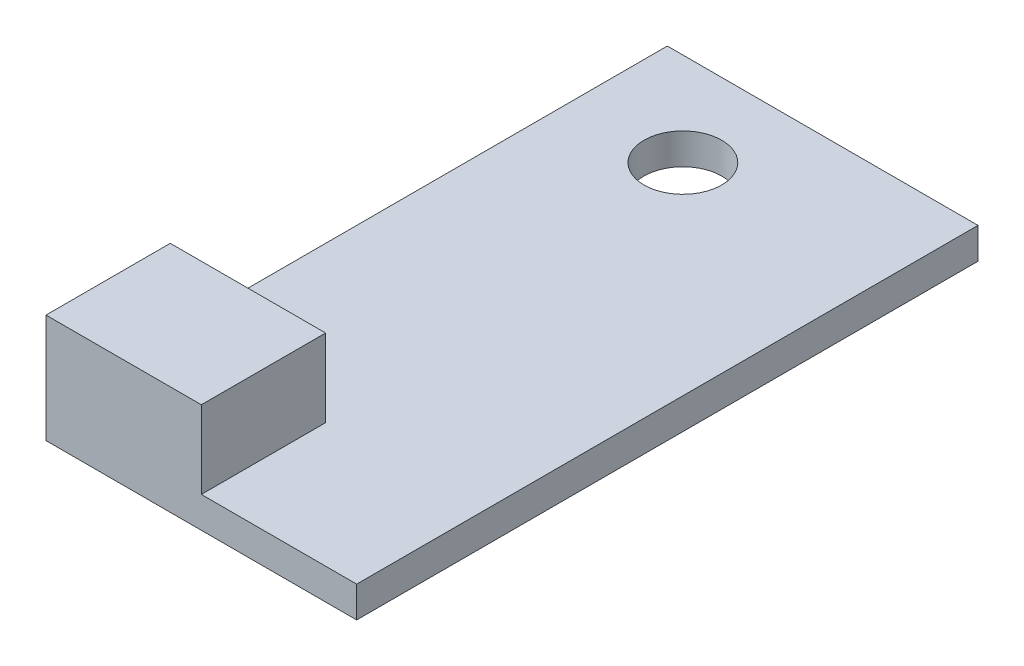
ISO-10303-21;
HEADER;
FILE_DESCRIPTION(('STEP AP214'),'2;1');
FILE_NAME('part.step','',(''),(''),'','','');
FILE_SCHEMA(('AUTOMOTIVE_DESIGN { 1 0 10303 214 1 1 1 1 }'));
ENDSEC;
DATA;
#1=APPLICATION_CONTEXT('core data for automotive mechanical design processes');
#2=APPLICATION_PROTOCOL_DEFINITION('international standard','automotive_design',2000,#1);
#3=PRODUCT_CONTEXT('',#1,'mechanical');
#4=PRODUCT('Part','Part','',(#3));
#5=PRODUCT_RELATED_PRODUCT_CATEGORY('part','',(#4));
#6=PRODUCT_DEFINITION_FORMATION('','',#4);
#7=PRODUCT_DEFINITION_CONTEXT('part definition',#1,'design');
#8=PRODUCT_DEFINITION('design','',#6,#7);
#9=PRODUCT_DEFINITION_SHAPE('','',#8);
#10=(LENGTH_UNIT() NAMED_UNIT(*) SI_UNIT(.MILLI.,.METRE.));
#11=(NAMED_UNIT(*) PLANE_ANGLE_UNIT() SI_UNIT($,.RADIAN.));
#12=(NAMED_UNIT(*) SI_UNIT($,.STERADIAN.) SOLID_ANGLE_UNIT());
#13=UNCERTAINTY_MEASURE_WITH_UNIT(LENGTH_MEASURE(1.E-05),#10,'distance_accuracy_value','');
#14=(GEOMETRIC_REPRESENTATION_CONTEXT(3) GLOBAL_UNCERTAINTY_ASSIGNED_CONTEXT((#13)) GLOBAL_UNIT_ASSIGNED_CONTEXT((#10,
#11,#12)) REPRESENTATION_CONTEXT('',''));
#15=CARTESIAN_POINT('',(0.,0.,0.));
#16=DIRECTION('',(0.,0.,1.));
#17=DIRECTION('',(1.,0.,0.));
#18=AXIS2_PLACEMENT_3D('',#15,#16,#17);
#19=CARTESIAN_POINT('',(0.,10.,0.));
#20=DIRECTION('',(0.,-1.,0.));
#21=DIRECTION('',(0.,0.,-1.));
#22=AXIS2_PLACEMENT_3D('',#19,#20,#21);
#23=PLANE('',#22);
#24=CARTESIAN_POINT('',(35.,10.,-170.));
#25=DIRECTION('',(0.,1.,0.));
#26=DIRECTION('',(0.,0.,1.));
#27=AXIS2_PLACEMENT_3D('',#24,#25,#26);
#28=CIRCLE('',#27,12.5);
#29=CARTESIAN_POINT('',(35.,10.,-157.5));
#30=VERTEX_POINT('',#29);
#31=EDGE_CURVE('E117',#30,#30,#28,.T.);
#32=ORIENTED_EDGE('',*,*,#31,.F.);
#33=EDGE_LOOP('',(#32));
#34=FACE_BOUND('',#33,.T.);
#35=DIRECTION('',(-1.,0.,0.));
#36=VECTOR('',#35,1.);
#37=CARTESIAN_POINT('',(0.,10.,-40.));
#38=LINE('',#37,#36);
#39=CARTESIAN_POINT('',(50.,10.,-40.));
#40=VERTEX_POINT('',#39);
#41=CARTESIAN_POINT('',(0.,10.,-40.));
#42=VERTEX_POINT('',#41);
#43=EDGE_CURVE('E113',#40,#42,#38,.T.);
#44=ORIENTED_EDGE('',*,*,#43,.F.);
#45=DIRECTION('',(0.,0.,-1.));
#46=VECTOR('',#45,1.);
#47=CARTESIAN_POINT('',(50.,10.,0.));
#48=LINE('',#47,#46);
#49=CARTESIAN_POINT('',(50.,10.,0.));
#50=VERTEX_POINT('',#49);
#51=EDGE_CURVE('E49',#50,#40,#48,.T.);
#52=ORIENTED_EDGE('',*,*,#51,.F.);
#53=DIRECTION('',(1.,0.,0.));
#54=VECTOR('',#53,1.);
#55=CARTESIAN_POINT('',(0.,10.,0.));
#56=LINE('',#55,#54);
#57=CARTESIAN_POINT('',(100.,10.,0.));
#58=VERTEX_POINT('',#57);
#59=EDGE_CURVE('E129',#50,#58,#56,.T.);
#60=ORIENTED_EDGE('',*,*,#59,.T.);
#61=DIRECTION('',(0.,0.,-1.));
#62=VECTOR('',#61,1.);
#63=CARTESIAN_POINT('',(100.,10.,0.));
#64=LINE('',#63,#62);
#65=CARTESIAN_POINT('',(100.,10.,-200.));
#66=VERTEX_POINT('',#65);
#67=EDGE_CURVE('E132',#58,#66,#64,.T.);
#68=ORIENTED_EDGE('',*,*,#67,.T.);
#69=DIRECTION('',(-1.,0.,0.));
#70=VECTOR('',#69,1.);
#71=CARTESIAN_POINT('',(0.,10.,-200.));
#72=LINE('',#71,#70);
#73=CARTESIAN_POINT('',(0.,10.,-200.));
#74=VERTEX_POINT('',#73);
#75=EDGE_CURVE('E134',#66,#74,#72,.T.);
#76=ORIENTED_EDGE('',*,*,#75,.T.);
#77=DIRECTION('',(0.,0.,1.));
#78=VECTOR('',#77,1.);
#79=CARTESIAN_POINT('',(0.,10.,0.));
#80=LINE('',#79,#78);
#81=EDGE_CURVE('E55',#74,#42,#80,.T.);
#82=ORIENTED_EDGE('',*,*,#81,.T.);
#83=EDGE_LOOP('',(#44,#52,#60,#68,#76,#82));
#84=FACE_BOUND('',#83,.T.);
#85=ADVANCED_FACE('F33',(#34,#84),#23,.F.);
#86=CARTESIAN_POINT('',(0.,10.,0.));
#87=DIRECTION('',(1.,0.,0.));
#88=DIRECTION('',(0.,0.,-1.));
#89=AXIS2_PLACEMENT_3D('',#86,#87,#88);
#90=PLANE('',#89);
#91=DIRECTION('',(0.,0.,1.));
#92=VECTOR('',#91,1.);
#93=CARTESIAN_POINT('',(0.,0.,0.));
#94=LINE('',#93,#92);
#95=CARTESIAN_POINT('',(0.,0.,-200.));
#96=VERTEX_POINT('',#95);
#97=CARTESIAN_POINT('',(0.,0.,0.));
#98=VERTEX_POINT('',#97);
#99=EDGE_CURVE('E98',#96,#98,#94,.T.);
#100=ORIENTED_EDGE('',*,*,#99,.T.);
#101=DIRECTION('',(0.,-1.,0.));
#102=VECTOR('',#101,1.);
#103=CARTESIAN_POINT('',(0.,10.,0.));
#104=LINE('',#103,#102);
#105=CARTESIAN_POINT('',(0.,35.,0.));
#106=VERTEX_POINT('',#105);
#107=EDGE_CURVE('E11',#106,#98,#104,.T.);
#108=ORIENTED_EDGE('',*,*,#107,.F.);
#109=DIRECTION('',(0.,0.,1.));
#110=VECTOR('',#109,1.);
#111=CARTESIAN_POINT('',(0.,35.,0.));
#112=LINE('',#111,#110);
#113=CARTESIAN_POINT('',(0.,35.,-40.));
#114=VERTEX_POINT('',#113);
#115=EDGE_CURVE('E95',#114,#106,#112,.T.);
#116=ORIENTED_EDGE('',*,*,#115,.F.);
#117=DIRECTION('',(0.,-1.,0.));
#118=VECTOR('',#117,1.);
#119=CARTESIAN_POINT('',(0.,35.,-40.));
#120=LINE('',#119,#118);
#121=EDGE_CURVE('E121',#114,#42,#120,.T.);
#122=ORIENTED_EDGE('',*,*,#121,.T.);
#123=ORIENTED_EDGE('',*,*,#81,.F.);
#124=DIRECTION('',(0.,-1.,0.));
#125=VECTOR('',#124,1.);
#126=CARTESIAN_POINT('',(0.,10.,-200.));
#127=LINE('',#126,#125);
#128=EDGE_CURVE('E136',#74,#96,#127,.T.);
#129=ORIENTED_EDGE('',*,*,#128,.T.);
#130=EDGE_LOOP('',(#100,#108,#116,#122,#123,#129));
#131=FACE_BOUND('',#130,.T.);
#132=ADVANCED_FACE('F35',(#131),#90,.F.);
#133=CARTESIAN_POINT('',(0.,10.,0.));
#134=DIRECTION('',(0.,0.,-1.));
#135=DIRECTION('',(-1.,0.,0.));
#136=AXIS2_PLACEMENT_3D('',#133,#134,#135);
#137=PLANE('',#136);
#138=DIRECTION('',(1.,0.,0.));
#139=VECTOR('',#138,1.);
#140=CARTESIAN_POINT('',(0.,0.,0.));
#141=LINE('',#140,#139);
#142=CARTESIAN_POINT('',(100.,0.,0.));
#143=VERTEX_POINT('',#142);
#144=EDGE_CURVE('E138',#98,#143,#141,.T.);
#145=ORIENTED_EDGE('',*,*,#144,.T.);
#146=DIRECTION('',(0.,-1.,0.));
#147=VECTOR('',#146,1.);
#148=CARTESIAN_POINT('',(100.,10.,0.));
#149=LINE('',#148,#147);
#150=EDGE_CURVE('E42',#58,#143,#149,.T.);
#151=ORIENTED_EDGE('',*,*,#150,.F.);
#152=ORIENTED_EDGE('',*,*,#59,.F.);
#153=DIRECTION('',(0.,-1.,0.));
#154=VECTOR('',#153,1.);
#155=CARTESIAN_POINT('',(50.,35.,0.));
#156=LINE('',#155,#154);
#157=CARTESIAN_POINT('',(50.,35.,0.));
#158=VERTEX_POINT('',#157);
#159=EDGE_CURVE('E104',#158,#50,#156,.T.);
#160=ORIENTED_EDGE('',*,*,#159,.F.);
#161=DIRECTION('',(1.,0.,0.));
#162=VECTOR('',#161,1.);
#163=CARTESIAN_POINT('',(0.,35.,0.));
#164=LINE('',#163,#162);
#165=EDGE_CURVE('E101',#106,#158,#164,.T.);
#166=ORIENTED_EDGE('',*,*,#165,.F.);
#167=ORIENTED_EDGE('',*,*,#107,.T.);
#168=EDGE_LOOP('',(#145,#151,#152,#160,#166,#167));
#169=FACE_BOUND('',#168,.T.);
#170=ADVANCED_FACE('F102',(#169),#137,.F.);
#171=CARTESIAN_POINT('',(100.,10.,0.));
#172=DIRECTION('',(-1.,0.,0.));
#173=DIRECTION('',(0.,0.,1.));
#174=AXIS2_PLACEMENT_3D('',#171,#172,#173);
#175=PLANE('',#174);
#176=DIRECTION('',(0.,0.,-1.));
#177=VECTOR('',#176,1.);
#178=CARTESIAN_POINT('',(100.,0.,0.));
#179=LINE('',#178,#177);
#180=CARTESIAN_POINT('',(100.,0.,-200.));
#181=VERTEX_POINT('',#180);
#182=EDGE_CURVE('E140',#143,#181,#179,.T.);
#183=ORIENTED_EDGE('',*,*,#182,.T.);
#184=DIRECTION('',(0.,-1.,0.));
#185=VECTOR('',#184,1.);
#186=CARTESIAN_POINT('',(100.,10.,-200.));
#187=LINE('',#186,#185);
#188=EDGE_CURVE('E144',#66,#181,#187,.T.);
#189=ORIENTED_EDGE('',*,*,#188,.F.);
#190=ORIENTED_EDGE('',*,*,#67,.F.);
#191=ORIENTED_EDGE('',*,*,#150,.T.);
#192=EDGE_LOOP('',(#183,#189,#190,#191));
#193=FACE_BOUND('',#192,.T.);
#194=ADVANCED_FACE('F152',(#193),#175,.F.);
#195=CARTESIAN_POINT('',(0.,10.,-200.));
#196=DIRECTION('',(0.,0.,1.));
#197=DIRECTION('',(1.,0.,0.));
#198=AXIS2_PLACEMENT_3D('',#195,#196,#197);
#199=PLANE('',#198);
#200=DIRECTION('',(-1.,0.,0.));
#201=VECTOR('',#200,1.);
#202=CARTESIAN_POINT('',(0.,0.,-200.));
#203=LINE('',#202,#201);
#204=EDGE_CURVE('E130',#181,#96,#203,.T.);
#205=ORIENTED_EDGE('',*,*,#204,.T.);
#206=ORIENTED_EDGE('',*,*,#128,.F.);
#207=ORIENTED_EDGE('',*,*,#75,.F.);
#208=ORIENTED_EDGE('',*,*,#188,.T.);
#209=EDGE_LOOP('',(#205,#206,#207,#208));
#210=FACE_BOUND('',#209,.T.);
#211=ADVANCED_FACE('F159',(#210),#199,.F.);
#212=CARTESIAN_POINT('',(0.,0.,0.));
#213=DIRECTION('',(0.,-1.,0.));
#214=DIRECTION('',(0.,0.,-1.));
#215=AXIS2_PLACEMENT_3D('',#212,#213,#214);
#216=PLANE('',#215);
#217=CARTESIAN_POINT('',(35.,0.,-170.));
#218=DIRECTION('',(0.,-1.,0.));
#219=DIRECTION('',(0.,0.,-1.));
#220=AXIS2_PLACEMENT_3D('',#217,#218,#219);
#221=CIRCLE('',#220,12.5);
#222=CARTESIAN_POINT('',(35.,0.,-182.5));
#223=VERTEX_POINT('',#222);
#224=EDGE_CURVE('E37',#223,#223,#221,.T.);
#225=ORIENTED_EDGE('',*,*,#224,.F.);
#226=EDGE_LOOP('',(#225));
#227=FACE_BOUND('',#226,.T.);
#228=ORIENTED_EDGE('',*,*,#99,.F.);
#229=ORIENTED_EDGE('',*,*,#204,.F.);
#230=ORIENTED_EDGE('',*,*,#182,.F.);
#231=ORIENTED_EDGE('',*,*,#144,.F.);
#232=EDGE_LOOP('',(#228,#229,#230,#231));
#233=FACE_BOUND('',#232,.T.);
#234=ADVANCED_FACE('F156',(#227,#233),#216,.T.);
#235=CARTESIAN_POINT('',(50.,35.,0.));
#236=DIRECTION('',(-1.,0.,0.));
#237=DIRECTION('',(0.,0.,1.));
#238=AXIS2_PLACEMENT_3D('',#235,#236,#237);
#239=PLANE('',#238);
#240=ORIENTED_EDGE('',*,*,#51,.T.);
#241=DIRECTION('',(0.,-1.,0.));
#242=VECTOR('',#241,1.);
#243=CARTESIAN_POINT('',(50.,35.,-40.));
#244=LINE('',#243,#242);
#245=CARTESIAN_POINT('',(50.,35.,-40.));
#246=VERTEX_POINT('',#245);
#247=EDGE_CURVE('E124',#246,#40,#244,.T.);
#248=ORIENTED_EDGE('',*,*,#247,.F.);
#249=DIRECTION('',(0.,0.,-1.));
#250=VECTOR('',#249,1.);
#251=CARTESIAN_POINT('',(50.,35.,0.));
#252=LINE('',#251,#250);
#253=EDGE_CURVE('E107',#158,#246,#252,.T.);
#254=ORIENTED_EDGE('',*,*,#253,.F.);
#255=ORIENTED_EDGE('',*,*,#159,.T.);
#256=EDGE_LOOP('',(#240,#248,#254,#255));
#257=FACE_BOUND('',#256,.T.);
#258=ADVANCED_FACE('F165',(#257),#239,.F.);
#259=CARTESIAN_POINT('',(0.,35.,-40.));
#260=DIRECTION('',(0.,0.,1.));
#261=DIRECTION('',(1.,0.,0.));
#262=AXIS2_PLACEMENT_3D('',#259,#260,#261);
#263=PLANE('',#262);
#264=ORIENTED_EDGE('',*,*,#43,.T.);
#265=ORIENTED_EDGE('',*,*,#121,.F.);
#266=DIRECTION('',(-1.,0.,0.));
#267=VECTOR('',#266,1.);
#268=CARTESIAN_POINT('',(0.,35.,-40.));
#269=LINE('',#268,#267);
#270=EDGE_CURVE('E111',#246,#114,#269,.T.);
#271=ORIENTED_EDGE('',*,*,#270,.F.);
#272=ORIENTED_EDGE('',*,*,#247,.T.);
#273=EDGE_LOOP('',(#264,#265,#271,#272));
#274=FACE_BOUND('',#273,.T.);
#275=ADVANCED_FACE('F162',(#274),#263,.F.);
#276=CARTESIAN_POINT('',(0.,35.,0.));
#277=DIRECTION('',(0.,-1.,0.));
#278=DIRECTION('',(0.,0.,-1.));
#279=AXIS2_PLACEMENT_3D('',#276,#277,#278);
#280=PLANE('',#279);
#281=ORIENTED_EDGE('',*,*,#115,.T.);
#282=ORIENTED_EDGE('',*,*,#165,.T.);
#283=ORIENTED_EDGE('',*,*,#253,.T.);
#284=ORIENTED_EDGE('',*,*,#270,.T.);
#285=EDGE_LOOP('',(#281,#282,#283,#284));
#286=FACE_BOUND('',#285,.T.);
#287=ADVANCED_FACE('F109',(#286),#280,.F.);
#288=CARTESIAN_POINT('',(35.,-15.,-170.));
#289=DIRECTION('',(0.,1.,0.));
#290=DIRECTION('',(0.,0.,1.));
#291=AXIS2_PLACEMENT_3D('',#288,#289,#290);
#292=CYLINDRICAL_SURFACE('',#291,12.5);
#293=ORIENTED_EDGE('',*,*,#224,.T.);
#294=EDGE_LOOP('',(#293));
#295=FACE_BOUND('',#294,.T.);
#296=ORIENTED_EDGE('',*,*,#31,.T.);
#297=EDGE_LOOP('',(#296));
#298=FACE_BOUND('',#297,.T.);
#299=ADVANCED_FACE('F211',(#295,#298),#292,.F.);
#300=CLOSED_SHELL('',(#85,#132,#170,#194,#211,#234,#258,#275,#287,#299));
#301=MANIFOLD_SOLID_BREP('B2',#300);
#302=ADVANCED_BREP_SHAPE_REPRESENTATION('',(#18,#301),#14);
#303=SHAPE_DEFINITION_REPRESENTATION(#9,#302);
ENDSEC;
END-ISO-10303-21;
